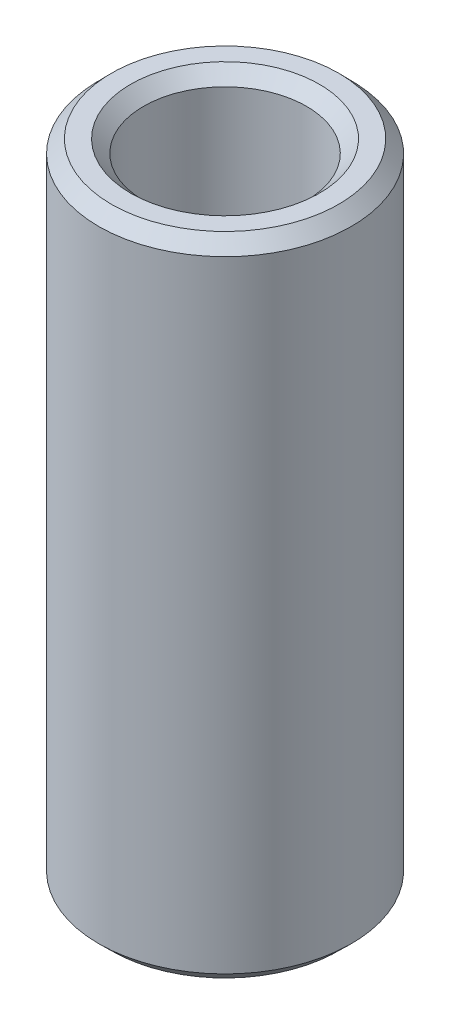
ISO-10303-21;
HEADER;
FILE_DESCRIPTION(('STEP AP214'),'2;1');
FILE_NAME('part.step','',(''),(''),'','','');
FILE_SCHEMA(('AUTOMOTIVE_DESIGN { 1 0 10303 214 1 1 1 1 }'));
ENDSEC;
DATA;
#1=APPLICATION_CONTEXT('core data for automotive mechanical design processes');
#2=APPLICATION_PROTOCOL_DEFINITION('international standard','automotive_design',2000,#1);
#3=PRODUCT_CONTEXT('',#1,'mechanical');
#4=PRODUCT('Part','Part','',(#3));
#5=PRODUCT_RELATED_PRODUCT_CATEGORY('part','',(#4));
#6=PRODUCT_DEFINITION_FORMATION('','',#4);
#7=PRODUCT_DEFINITION_CONTEXT('part definition',#1,'design');
#8=PRODUCT_DEFINITION('design','',#6,#7);
#9=PRODUCT_DEFINITION_SHAPE('','',#8);
#10=(LENGTH_UNIT() NAMED_UNIT(*) SI_UNIT(.MILLI.,.METRE.));
#11=(NAMED_UNIT(*) PLANE_ANGLE_UNIT() SI_UNIT($,.RADIAN.));
#12=(NAMED_UNIT(*) SI_UNIT($,.STERADIAN.) SOLID_ANGLE_UNIT());
#13=UNCERTAINTY_MEASURE_WITH_UNIT(LENGTH_MEASURE(1.E-05),#10,'distance_accuracy_value','');
#14=(GEOMETRIC_REPRESENTATION_CONTEXT(3) GLOBAL_UNCERTAINTY_ASSIGNED_CONTEXT((#13)) GLOBAL_UNIT_ASSIGNED_CONTEXT((#10,
#11,#12)) REPRESENTATION_CONTEXT('',''));
#15=CARTESIAN_POINT('',(0.,0.,0.));
#16=DIRECTION('',(0.,0.,1.));
#17=DIRECTION('',(1.,0.,0.));
#18=AXIS2_PLACEMENT_3D('',#15,#16,#17);
#19=CARTESIAN_POINT('',(0.,38.4156992605323,0.));
#20=DIRECTION('',(0.,-1.,0.));
#21=DIRECTION('',(0.,0.,-1.));
#22=AXIS2_PLACEMENT_3D('',#19,#20,#21);
#23=CYLINDRICAL_SURFACE('',#22,7.5);
#24=CARTESIAN_POINT('',(0.,0.75076273802429,0.));
#25=DIRECTION('',(0.,1.,0.));
#26=DIRECTION('',(0.,0.,1.));
#27=AXIS2_PLACEMENT_3D('',#24,#25,#26);
#28=CIRCLE('',#27,7.5);
#29=CARTESIAN_POINT('',(0.,0.75076273802429,7.5));
#30=VERTEX_POINT('',#29);
#31=EDGE_CURVE('E10',#30,#30,#28,.T.);
#32=ORIENTED_EDGE('',*,*,#31,.T.);
#33=EDGE_LOOP('',(#32));
#34=FACE_BOUND('',#33,.T.);
#35=CARTESIAN_POINT('',(0.,37.6497514117755,0.));
#36=DIRECTION('',(0.,1.,0.));
#37=DIRECTION('',(0.,0.,1.));
#38=AXIS2_PLACEMENT_3D('',#35,#36,#37);
#39=CIRCLE('',#38,7.5);
#40=CARTESIAN_POINT('',(0.,37.6497514117755,7.5));
#41=VERTEX_POINT('',#40);
#42=EDGE_CURVE('E50',#41,#41,#39,.F.);
#43=ORIENTED_EDGE('',*,*,#42,.T.);
#44=EDGE_LOOP('',(#43));
#45=FACE_BOUND('',#44,.T.);
#46=ADVANCED_FACE('F39',(#34,#45),#23,.T.);
#47=CARTESIAN_POINT('',(0.,38.4156992605323,0.));
#48=DIRECTION('',(0.,1.,0.));
#49=DIRECTION('',(0.,0.,1.));
#50=AXIS2_PLACEMENT_3D('',#47,#48,#49);
#51=PLANE('',#50);
#52=CARTESIAN_POINT('',(0.,38.4156992605323,0.));
#53=DIRECTION('',(0.,1.,0.));
#54=DIRECTION('',(0.,0.,1.));
#55=AXIS2_PLACEMENT_3D('',#52,#53,#54);
#56=CIRCLE('',#55,5.60834852628666);
#57=CARTESIAN_POINT('',(0.,38.4156992605323,5.60834852628666));
#58=VERTEX_POINT('',#57);
#59=EDGE_CURVE('E58',#58,#58,#56,.F.);
#60=ORIENTED_EDGE('',*,*,#59,.T.);
#61=EDGE_LOOP('',(#60));
#62=FACE_BOUND('',#61,.T.);
#63=CARTESIAN_POINT('',(0.,38.4156992605323,0.));
#64=DIRECTION('',(0.,1.,0.));
#65=DIRECTION('',(0.,0.,1.));
#66=AXIS2_PLACEMENT_3D('',#63,#64,#65);
#67=CIRCLE('',#66,6.7492372619757);
#68=CARTESIAN_POINT('',(0.,38.4156992605323,6.7492372619757));
#69=VERTEX_POINT('',#68);
#70=EDGE_CURVE('E61',#69,#69,#67,.T.);
#71=ORIENTED_EDGE('',*,*,#70,.T.);
#72=EDGE_LOOP('',(#71));
#73=FACE_BOUND('',#72,.T.);
#74=ADVANCED_FACE('F88',(#62,#73),#51,.T.);
#75=CARTESIAN_POINT('',(0.,0.,0.));
#76=DIRECTION('',(0.,1.,0.));
#77=DIRECTION('',(0.,0.,1.));
#78=AXIS2_PLACEMENT_3D('',#75,#76,#77);
#79=PLANE('',#78);
#80=CARTESIAN_POINT('',(0.,0.,0.));
#81=DIRECTION('',(0.,1.,0.));
#82=DIRECTION('',(0.,0.,1.));
#83=AXIS2_PLACEMENT_3D('',#80,#81,#82);
#84=CIRCLE('',#83,5.59316341555414);
#85=CARTESIAN_POINT('',(0.,0.,5.59316341555414));
#86=VERTEX_POINT('',#85);
#87=EDGE_CURVE('E51',#86,#86,#84,.T.);
#88=ORIENTED_EDGE('',*,*,#87,.T.);
#89=EDGE_LOOP('',(#88));
#90=FACE_BOUND('',#89,.T.);
#91=CARTESIAN_POINT('',(0.,0.,0.));
#92=DIRECTION('',(0.,1.,0.));
#93=DIRECTION('',(0.,0.,1.));
#94=AXIS2_PLACEMENT_3D('',#91,#92,#93);
#95=CIRCLE('',#94,6.73405215124318);
#96=CARTESIAN_POINT('',(0.,0.,6.73405215124318));
#97=VERTEX_POINT('',#96);
#98=EDGE_CURVE('E54',#97,#97,#95,.F.);
#99=ORIENTED_EDGE('',*,*,#98,.T.);
#100=EDGE_LOOP('',(#99));
#101=FACE_BOUND('',#100,.T.);
#102=ADVANCED_FACE('F83',(#90,#101),#79,.F.);
#103=CARTESIAN_POINT('',(0.,38.4156992605323,0.));
#104=DIRECTION('',(0.,-1.,0.));
#105=DIRECTION('',(0.,0.,-1.));
#106=AXIS2_PLACEMENT_3D('',#103,#104,#105);
#107=CYLINDRICAL_SURFACE('',#106,4.84240067752984);
#108=CARTESIAN_POINT('',(0.,37.664936522508,0.));
#109=DIRECTION('',(0.,1.,0.));
#110=DIRECTION('',(0.,0.,1.));
#111=AXIS2_PLACEMENT_3D('',#108,#109,#110);
#112=CIRCLE('',#111,4.84240067752984);
#113=CARTESIAN_POINT('',(0.,37.664936522508,4.84240067752984));
#114=VERTEX_POINT('',#113);
#115=EDGE_CURVE('E67',#114,#114,#112,.T.);
#116=ORIENTED_EDGE('',*,*,#115,.T.);
#117=EDGE_LOOP('',(#116));
#118=FACE_BOUND('',#117,.T.);
#119=CARTESIAN_POINT('',(0.,0.765947848756825,0.));
#120=DIRECTION('',(0.,1.,0.));
#121=DIRECTION('',(0.,0.,1.));
#122=AXIS2_PLACEMENT_3D('',#119,#120,#121);
#123=CIRCLE('',#122,4.84240067752984);
#124=CARTESIAN_POINT('',(0.,0.765947848756825,4.84240067752984));
#125=VERTEX_POINT('',#124);
#126=EDGE_CURVE('E69',#125,#125,#123,.F.);
#127=ORIENTED_EDGE('',*,*,#126,.T.);
#128=EDGE_LOOP('',(#127));
#129=FACE_BOUND('',#128,.T.);
#130=ADVANCED_FACE('F71',(#118,#129),#107,.F.);
#131=CARTESIAN_POINT('',(0.,37.664936522508,0.));
#132=DIRECTION('',(0.,1.,0.));
#133=DIRECTION('',(0.,0.,1.));
#134=AXIS2_PLACEMENT_3D('',#131,#132,#133);
#135=CONICAL_SURFACE('',#134,4.84240067752984,0.795409699891332);
#136=ORIENTED_EDGE('',*,*,#59,.F.);
#137=EDGE_LOOP('',(#136));
#138=FACE_BOUND('',#137,.T.);
#139=ORIENTED_EDGE('',*,*,#115,.F.);
#140=EDGE_LOOP('',(#139));
#141=FACE_BOUND('',#140,.T.);
#142=ADVANCED_FACE('F77',(#138,#141),#135,.F.);
#143=CARTESIAN_POINT('',(0.,0.,0.));
#144=DIRECTION('',(0.,-1.,0.));
#145=DIRECTION('',(0.,0.,-1.));
#146=AXIS2_PLACEMENT_3D('',#143,#144,#145);
#147=CONICAL_SURFACE('',#146,5.59316341555414,0.775386626903562);
#148=ORIENTED_EDGE('',*,*,#126,.F.);
#149=EDGE_LOOP('',(#148));
#150=FACE_BOUND('',#149,.T.);
#151=ORIENTED_EDGE('',*,*,#87,.F.);
#152=EDGE_LOOP('',(#151));
#153=FACE_BOUND('',#152,.T.);
#154=ADVANCED_FACE('F73',(#150,#153),#147,.F.);
#155=CARTESIAN_POINT('',(0.,0.75076273802429,0.));
#156=DIRECTION('',(0.,1.,0.));
#157=DIRECTION('',(0.,0.,1.));
#158=AXIS2_PLACEMENT_3D('',#155,#156,#157);
#159=CONICAL_SURFACE('',#158,7.5,0.795409699891335);
#160=ORIENTED_EDGE('',*,*,#98,.F.);
#161=EDGE_LOOP('',(#160));
#162=FACE_BOUND('',#161,.T.);
#163=ORIENTED_EDGE('',*,*,#31,.F.);
#164=EDGE_LOOP('',(#163));
#165=FACE_BOUND('',#164,.T.);
#166=ADVANCED_FACE('F76',(#162,#165),#159,.T.);
#167=CARTESIAN_POINT('',(0.,38.4156992605323,0.));
#168=DIRECTION('',(0.,-1.,0.));
#169=DIRECTION('',(0.,0.,-1.));
#170=AXIS2_PLACEMENT_3D('',#167,#168,#169);
#171=CONICAL_SURFACE('',#170,6.7492372619757,0.775386626903564);
#172=ORIENTED_EDGE('',*,*,#42,.F.);
#173=EDGE_LOOP('',(#172));
#174=FACE_BOUND('',#173,.T.);
#175=ORIENTED_EDGE('',*,*,#70,.F.);
#176=EDGE_LOOP('',(#175));
#177=FACE_BOUND('',#176,.T.);
#178=ADVANCED_FACE('F45',(#174,#177),#171,.T.);
#179=CLOSED_SHELL('',(#46,#74,#102,#130,#142,#154,#166,#178));
#180=MANIFOLD_SOLID_BREP('B2',#179);
#181=ADVANCED_BREP_SHAPE_REPRESENTATION('',(#18,#180),#14);
#182=SHAPE_DEFINITION_REPRESENTATION(#9,#181);
ENDSEC;
END-ISO-10303-21;
